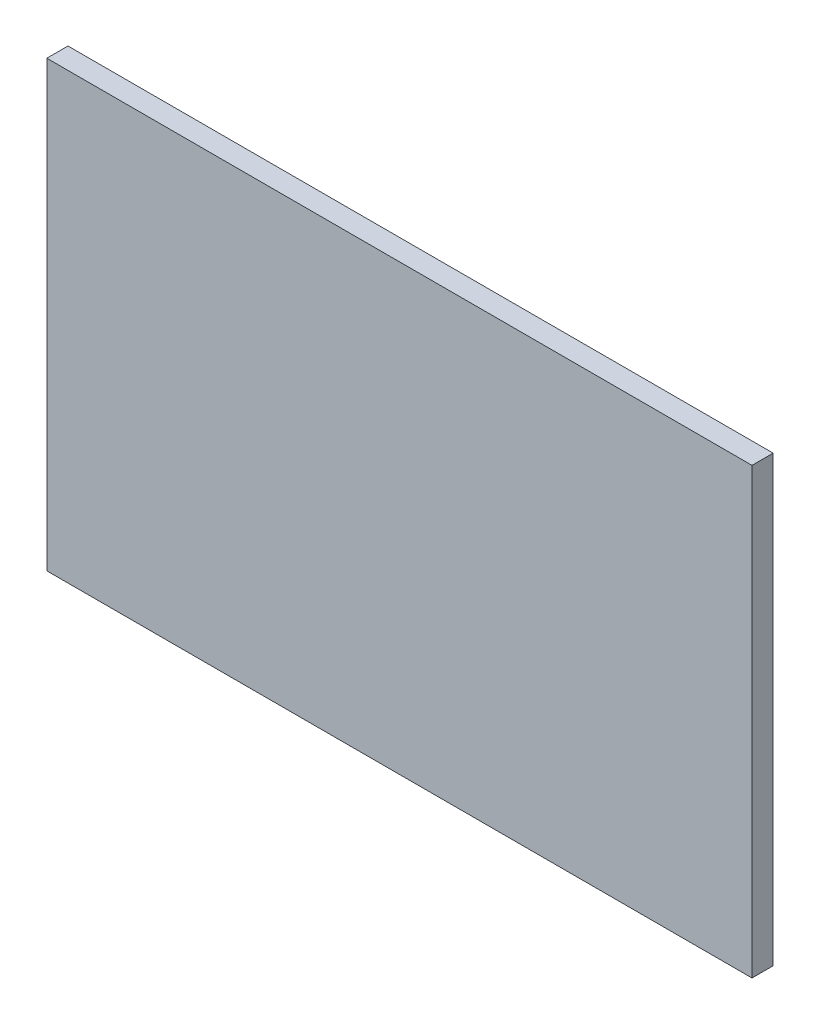
ISO-10303-21;
HEADER;
FILE_DESCRIPTION(('STEP AP214'),'2;1');
FILE_NAME('part.step','',(''),(''),'','','');
FILE_SCHEMA(('AUTOMOTIVE_DESIGN { 1 0 10303 214 1 1 1 1 }'));
ENDSEC;
DATA;
#1=APPLICATION_CONTEXT('core data for automotive mechanical design processes');
#2=APPLICATION_PROTOCOL_DEFINITION('international standard','automotive_design',2000,#1);
#3=PRODUCT_CONTEXT('',#1,'mechanical');
#4=PRODUCT('Part','Part','',(#3));
#5=PRODUCT_RELATED_PRODUCT_CATEGORY('part','',(#4));
#6=PRODUCT_DEFINITION_FORMATION('','',#4);
#7=PRODUCT_DEFINITION_CONTEXT('part definition',#1,'design');
#8=PRODUCT_DEFINITION('design','',#6,#7);
#9=PRODUCT_DEFINITION_SHAPE('','',#8);
#10=(LENGTH_UNIT() NAMED_UNIT(*) SI_UNIT(.MILLI.,.METRE.));
#11=(NAMED_UNIT(*) PLANE_ANGLE_UNIT() SI_UNIT($,.RADIAN.));
#12=(NAMED_UNIT(*) SI_UNIT($,.STERADIAN.) SOLID_ANGLE_UNIT());
#13=UNCERTAINTY_MEASURE_WITH_UNIT(LENGTH_MEASURE(1.E-05),#10,'distance_accuracy_value','');
#14=(GEOMETRIC_REPRESENTATION_CONTEXT(3) GLOBAL_UNCERTAINTY_ASSIGNED_CONTEXT((#13)) GLOBAL_UNIT_ASSIGNED_CONTEXT((#10,
#11,#12)) REPRESENTATION_CONTEXT('',''));
#15=CARTESIAN_POINT('',(0.,0.,0.));
#16=DIRECTION('',(0.,0.,1.));
#17=DIRECTION('',(1.,0.,0.));
#18=AXIS2_PLACEMENT_3D('',#15,#16,#17);
#19=CARTESIAN_POINT('',(-557.5,351.,33.45));
#20=DIRECTION('',(1.,0.,0.));
#21=DIRECTION('',(0.,1.,0.));
#22=AXIS2_PLACEMENT_3D('',#19,#20,#21);
#23=PLANE('',#22);
#24=DIRECTION('',(0.,-1.,0.));
#25=VECTOR('',#24,1.);
#26=CARTESIAN_POINT('',(-557.5,351.,0.));
#27=LINE('',#26,#25);
#28=CARTESIAN_POINT('',(-557.5,351.,0.));
#29=VERTEX_POINT('',#28);
#30=CARTESIAN_POINT('',(-557.5,-351.,0.));
#31=VERTEX_POINT('',#30);
#32=EDGE_CURVE('E113',#29,#31,#27,.T.);
#33=ORIENTED_EDGE('',*,*,#32,.T.);
#34=DIRECTION('',(0.,0.,-1.));
#35=VECTOR('',#34,1.);
#36=CARTESIAN_POINT('',(-557.5,-351.,33.45));
#37=LINE('',#36,#35);
#38=CARTESIAN_POINT('',(-557.5,-351.,33.45));
#39=VERTEX_POINT('',#38);
#40=EDGE_CURVE('E11',#39,#31,#37,.T.);
#41=ORIENTED_EDGE('',*,*,#40,.F.);
#42=DIRECTION('',(0.,-1.,0.));
#43=VECTOR('',#42,1.);
#44=CARTESIAN_POINT('',(-557.5,351.,33.45));
#45=LINE('',#44,#43);
#46=CARTESIAN_POINT('',(-557.5,351.,33.45));
#47=VERTEX_POINT('',#46);
#48=EDGE_CURVE('E97',#47,#39,#45,.T.);
#49=ORIENTED_EDGE('',*,*,#48,.F.);
#50=DIRECTION('',(0.,0.,-1.));
#51=VECTOR('',#50,1.);
#52=CARTESIAN_POINT('',(-557.5,351.,33.45));
#53=LINE('',#52,#51);
#54=EDGE_CURVE('E109',#47,#29,#53,.T.);
#55=ORIENTED_EDGE('',*,*,#54,.T.);
#56=EDGE_LOOP('',(#33,#41,#49,#55));
#57=FACE_BOUND('',#56,.T.);
#58=ADVANCED_FACE('F45',(#57),#23,.F.);
#59=CARTESIAN_POINT('',(557.5,-351.,33.45));
#60=DIRECTION('',(0.,1.,0.));
#61=DIRECTION('',(-1.,0.,0.));
#62=AXIS2_PLACEMENT_3D('',#59,#60,#61);
#63=PLANE('',#62);
#64=DIRECTION('',(1.,0.,0.));
#65=VECTOR('',#64,1.);
#66=CARTESIAN_POINT('',(557.5,-351.,0.));
#67=LINE('',#66,#65);
#68=CARTESIAN_POINT('',(557.5,-351.,0.));
#69=VERTEX_POINT('',#68);
#70=EDGE_CURVE('E102',#31,#69,#67,.T.);
#71=ORIENTED_EDGE('',*,*,#70,.T.);
#72=DIRECTION('',(0.,0.,-1.));
#73=VECTOR('',#72,1.);
#74=CARTESIAN_POINT('',(557.5,-351.,33.45));
#75=LINE('',#74,#73);
#76=CARTESIAN_POINT('',(557.5,-351.,33.45));
#77=VERTEX_POINT('',#76);
#78=EDGE_CURVE('E54',#77,#69,#75,.T.);
#79=ORIENTED_EDGE('',*,*,#78,.F.);
#80=DIRECTION('',(1.,0.,0.));
#81=VECTOR('',#80,1.);
#82=CARTESIAN_POINT('',(557.5,-351.,33.45));
#83=LINE('',#82,#81);
#84=EDGE_CURVE('E92',#39,#77,#83,.T.);
#85=ORIENTED_EDGE('',*,*,#84,.F.);
#86=ORIENTED_EDGE('',*,*,#40,.T.);
#87=EDGE_LOOP('',(#71,#79,#85,#86));
#88=FACE_BOUND('',#87,.T.);
#89=ADVANCED_FACE('F101',(#88),#63,.F.);
#90=CARTESIAN_POINT('',(557.5,351.,33.45));
#91=DIRECTION('',(-1.,0.,0.));
#92=DIRECTION('',(0.,-1.,0.));
#93=AXIS2_PLACEMENT_3D('',#90,#91,#92);
#94=PLANE('',#93);
#95=DIRECTION('',(0.,1.,0.));
#96=VECTOR('',#95,1.);
#97=CARTESIAN_POINT('',(557.5,351.,0.));
#98=LINE('',#97,#96);
#99=CARTESIAN_POINT('',(557.5,351.,0.));
#100=VERTEX_POINT('',#99);
#101=EDGE_CURVE('E79',#69,#100,#98,.T.);
#102=ORIENTED_EDGE('',*,*,#101,.T.);
#103=DIRECTION('',(0.,0.,-1.));
#104=VECTOR('',#103,1.);
#105=CARTESIAN_POINT('',(557.5,351.,33.45));
#106=LINE('',#105,#104);
#107=CARTESIAN_POINT('',(557.5,351.,33.45));
#108=VERTEX_POINT('',#107);
#109=EDGE_CURVE('E104',#108,#100,#106,.T.);
#110=ORIENTED_EDGE('',*,*,#109,.F.);
#111=DIRECTION('',(0.,1.,0.));
#112=VECTOR('',#111,1.);
#113=CARTESIAN_POINT('',(557.5,351.,33.45));
#114=LINE('',#113,#112);
#115=EDGE_CURVE('E95',#77,#108,#114,.T.);
#116=ORIENTED_EDGE('',*,*,#115,.F.);
#117=ORIENTED_EDGE('',*,*,#78,.T.);
#118=EDGE_LOOP('',(#102,#110,#116,#117));
#119=FACE_BOUND('',#118,.T.);
#120=ADVANCED_FACE('F105',(#119),#94,.F.);
#121=CARTESIAN_POINT('',(557.5,351.,33.45));
#122=DIRECTION('',(0.,-1.,0.));
#123=DIRECTION('',(1.,0.,0.));
#124=AXIS2_PLACEMENT_3D('',#121,#122,#123);
#125=PLANE('',#124);
#126=DIRECTION('',(-1.,0.,0.));
#127=VECTOR('',#126,1.);
#128=CARTESIAN_POINT('',(557.5,351.,0.));
#129=LINE('',#128,#127);
#130=EDGE_CURVE('E85',#100,#29,#129,.T.);
#131=ORIENTED_EDGE('',*,*,#130,.T.);
#132=ORIENTED_EDGE('',*,*,#54,.F.);
#133=DIRECTION('',(-1.,0.,0.));
#134=VECTOR('',#133,1.);
#135=CARTESIAN_POINT('',(557.5,351.,33.45));
#136=LINE('',#135,#134);
#137=EDGE_CURVE('E62',#108,#47,#136,.T.);
#138=ORIENTED_EDGE('',*,*,#137,.F.);
#139=ORIENTED_EDGE('',*,*,#109,.T.);
#140=EDGE_LOOP('',(#131,#132,#138,#139));
#141=FACE_BOUND('',#140,.T.);
#142=ADVANCED_FACE('F126',(#141),#125,.F.);
#143=CARTESIAN_POINT('',(0.,0.,33.45));
#144=DIRECTION('',(0.,0.,-1.));
#145=DIRECTION('',(-1.,0.,0.));
#146=AXIS2_PLACEMENT_3D('',#143,#144,#145);
#147=PLANE('',#146);
#148=ORIENTED_EDGE('',*,*,#48,.T.);
#149=ORIENTED_EDGE('',*,*,#84,.T.);
#150=ORIENTED_EDGE('',*,*,#115,.T.);
#151=ORIENTED_EDGE('',*,*,#137,.T.);
#152=EDGE_LOOP('',(#148,#149,#150,#151));
#153=FACE_BOUND('',#152,.T.);
#154=ADVANCED_FACE('F93',(#153),#147,.F.);
#155=CARTESIAN_POINT('',(0.,0.,0.));
#156=DIRECTION('',(0.,0.,-1.));
#157=DIRECTION('',(-1.,0.,0.));
#158=AXIS2_PLACEMENT_3D('',#155,#156,#157);
#159=PLANE('',#158);
#160=ORIENTED_EDGE('',*,*,#32,.F.);
#161=ORIENTED_EDGE('',*,*,#130,.F.);
#162=ORIENTED_EDGE('',*,*,#101,.F.);
#163=ORIENTED_EDGE('',*,*,#70,.F.);
#164=EDGE_LOOP('',(#160,#161,#162,#163));
#165=FACE_BOUND('',#164,.T.);
#166=ADVANCED_FACE('F129',(#165),#159,.T.);
#167=CLOSED_SHELL('',(#58,#89,#120,#142,#154,#166));
#168=MANIFOLD_SOLID_BREP('B2',#167);
#169=ADVANCED_BREP_SHAPE_REPRESENTATION('',(#18,#168),#14);
#170=SHAPE_DEFINITION_REPRESENTATION(#9,#169);
ENDSEC;
END-ISO-10303-21;
